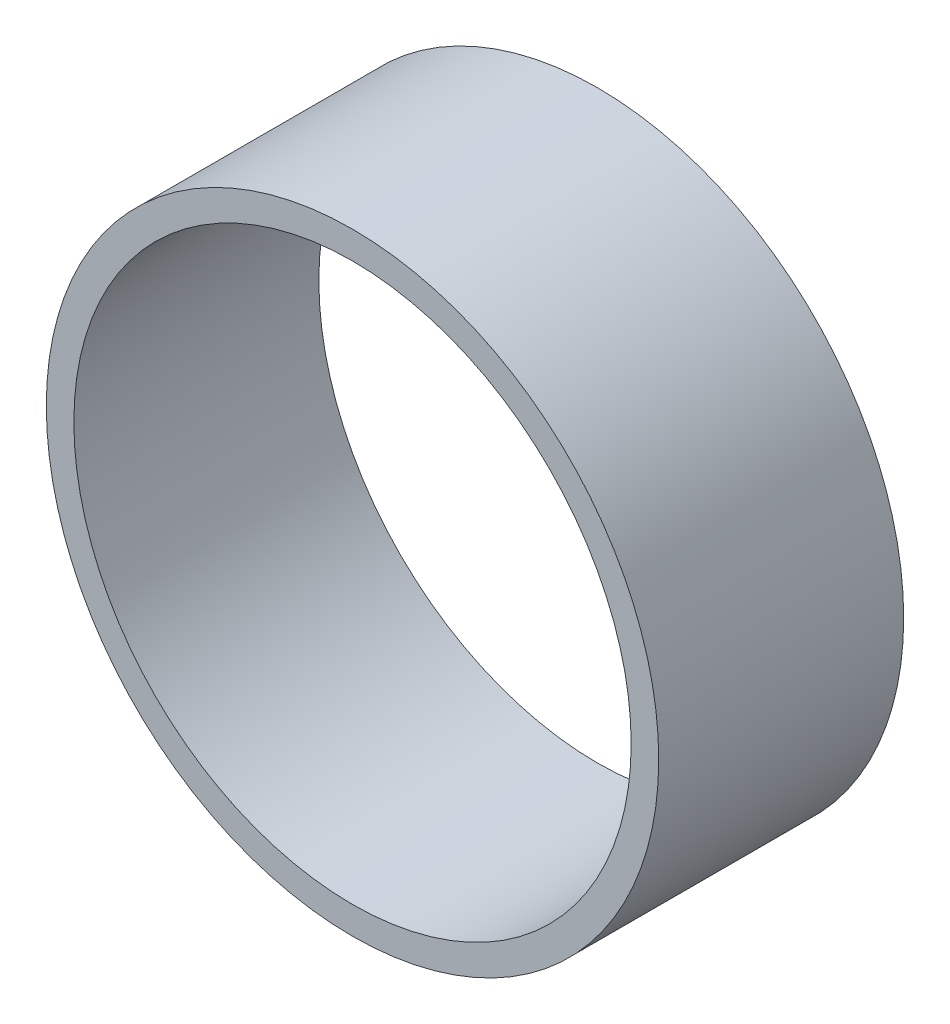
ISO-10303-21;
HEADER;
FILE_DESCRIPTION(('STEP AP214'),'2;1');
FILE_NAME('part.step','',(''),(''),'','','');
FILE_SCHEMA(('AUTOMOTIVE_DESIGN { 1 0 10303 214 1 1 1 1 }'));
ENDSEC;
DATA;
#1=APPLICATION_CONTEXT('core data for automotive mechanical design processes');
#2=APPLICATION_PROTOCOL_DEFINITION('international standard','automotive_design',2000,#1);
#3=PRODUCT_CONTEXT('',#1,'mechanical');
#4=PRODUCT('Part','Part','',(#3));
#5=PRODUCT_RELATED_PRODUCT_CATEGORY('part','',(#4));
#6=PRODUCT_DEFINITION_FORMATION('','',#4);
#7=PRODUCT_DEFINITION_CONTEXT('part definition',#1,'design');
#8=PRODUCT_DEFINITION('design','',#6,#7);
#9=PRODUCT_DEFINITION_SHAPE('','',#8);
#10=(LENGTH_UNIT() NAMED_UNIT(*) SI_UNIT(.MILLI.,.METRE.));
#11=(NAMED_UNIT(*) PLANE_ANGLE_UNIT() SI_UNIT($,.RADIAN.));
#12=(NAMED_UNIT(*) SI_UNIT($,.STERADIAN.) SOLID_ANGLE_UNIT());
#13=UNCERTAINTY_MEASURE_WITH_UNIT(LENGTH_MEASURE(1.E-05),#10,'distance_accuracy_value','');
#14=(GEOMETRIC_REPRESENTATION_CONTEXT(3) GLOBAL_UNCERTAINTY_ASSIGNED_CONTEXT((#13)) GLOBAL_UNIT_ASSIGNED_CONTEXT((#10,
#11,#12)) REPRESENTATION_CONTEXT('',''));
#15=CARTESIAN_POINT('',(0.,0.,0.));
#16=DIRECTION('',(0.,0.,1.));
#17=DIRECTION('',(1.,0.,0.));
#18=AXIS2_PLACEMENT_3D('',#15,#16,#17);
#19=CARTESIAN_POINT('',(0.,0.,4.));
#20=DIRECTION('',(0.,0.,1.));
#21=DIRECTION('',(1.,0.,0.));
#22=AXIS2_PLACEMENT_3D('',#19,#20,#21);
#23=PLANE('',#22);
#24=CARTESIAN_POINT('',(0.,0.,4.));
#25=DIRECTION('',(0.,0.,1.));
#26=DIRECTION('',(1.,0.,0.));
#27=AXIS2_PLACEMENT_3D('',#24,#25,#26);
#28=CIRCLE('',#27,5.);
#29=CARTESIAN_POINT('',(5.,0.,4.));
#30=VERTEX_POINT('',#29);
#31=EDGE_CURVE('E10',#30,#30,#28,.T.);
#32=ORIENTED_EDGE('',*,*,#31,.T.);
#33=EDGE_LOOP('',(#32));
#34=FACE_BOUND('',#33,.T.);
#35=CARTESIAN_POINT('',(0.,0.,4.));
#36=DIRECTION('',(0.,0.,1.));
#37=DIRECTION('',(1.,0.,0.));
#38=AXIS2_PLACEMENT_3D('',#35,#36,#37);
#39=CIRCLE('',#38,4.55);
#40=CARTESIAN_POINT('',(4.55,0.,4.));
#41=VERTEX_POINT('',#40);
#42=EDGE_CURVE('E54',#41,#41,#39,.T.);
#43=ORIENTED_EDGE('',*,*,#42,.F.);
#44=EDGE_LOOP('',(#43));
#45=FACE_BOUND('',#44,.T.);
#46=ADVANCED_FACE('F41',(#34,#45),#23,.T.);
#47=CARTESIAN_POINT('',(0.,0.,0.));
#48=DIRECTION('',(0.,0.,1.));
#49=DIRECTION('',(1.,0.,0.));
#50=AXIS2_PLACEMENT_3D('',#47,#48,#49);
#51=PLANE('',#50);
#52=CARTESIAN_POINT('',(0.,0.,0.));
#53=DIRECTION('',(0.,0.,1.));
#54=DIRECTION('',(1.,0.,0.));
#55=AXIS2_PLACEMENT_3D('',#52,#53,#54);
#56=CIRCLE('',#55,5.);
#57=CARTESIAN_POINT('',(5.,0.,0.));
#58=VERTEX_POINT('',#57);
#59=EDGE_CURVE('E45',#58,#58,#56,.T.);
#60=ORIENTED_EDGE('',*,*,#59,.F.);
#61=EDGE_LOOP('',(#60));
#62=FACE_BOUND('',#61,.T.);
#63=CARTESIAN_POINT('',(0.,0.,0.));
#64=DIRECTION('',(0.,0.,1.));
#65=DIRECTION('',(1.,0.,0.));
#66=AXIS2_PLACEMENT_3D('',#63,#64,#65);
#67=CIRCLE('',#66,4.55);
#68=CARTESIAN_POINT('',(4.55,0.,0.));
#69=VERTEX_POINT('',#68);
#70=EDGE_CURVE('E56',#69,#69,#67,.T.);
#71=ORIENTED_EDGE('',*,*,#70,.T.);
#72=EDGE_LOOP('',(#71));
#73=FACE_BOUND('',#72,.T.);
#74=ADVANCED_FACE('F68',(#62,#73),#51,.F.);
#75=CARTESIAN_POINT('',(0.,0.,4.));
#76=DIRECTION('',(0.,0.,-1.));
#77=DIRECTION('',(-1.,0.,0.));
#78=AXIS2_PLACEMENT_3D('',#75,#76,#77);
#79=CYLINDRICAL_SURFACE('',#78,5.);
#80=ORIENTED_EDGE('',*,*,#31,.F.);
#81=EDGE_LOOP('',(#80));
#82=FACE_BOUND('',#81,.T.);
#83=ORIENTED_EDGE('',*,*,#59,.T.);
#84=EDGE_LOOP('',(#83));
#85=FACE_BOUND('',#84,.T.);
#86=ADVANCED_FACE('F43',(#82,#85),#79,.T.);
#87=CARTESIAN_POINT('',(0.,0.,4.));
#88=DIRECTION('',(0.,0.,-1.));
#89=DIRECTION('',(-1.,0.,0.));
#90=AXIS2_PLACEMENT_3D('',#87,#88,#89);
#91=CYLINDRICAL_SURFACE('',#90,4.55);
#92=ORIENTED_EDGE('',*,*,#42,.T.);
#93=EDGE_LOOP('',(#92));
#94=FACE_BOUND('',#93,.T.);
#95=ORIENTED_EDGE('',*,*,#70,.F.);
#96=EDGE_LOOP('',(#95));
#97=FACE_BOUND('',#96,.T.);
#98=ADVANCED_FACE('F64',(#94,#97),#91,.F.);
#99=CLOSED_SHELL('',(#46,#74,#86,#98));
#100=MANIFOLD_SOLID_BREP('B2',#99);
#101=ADVANCED_BREP_SHAPE_REPRESENTATION('',(#18,#100),#14);
#102=SHAPE_DEFINITION_REPRESENTATION(#9,#101);
ENDSEC;
END-ISO-10303-21;
